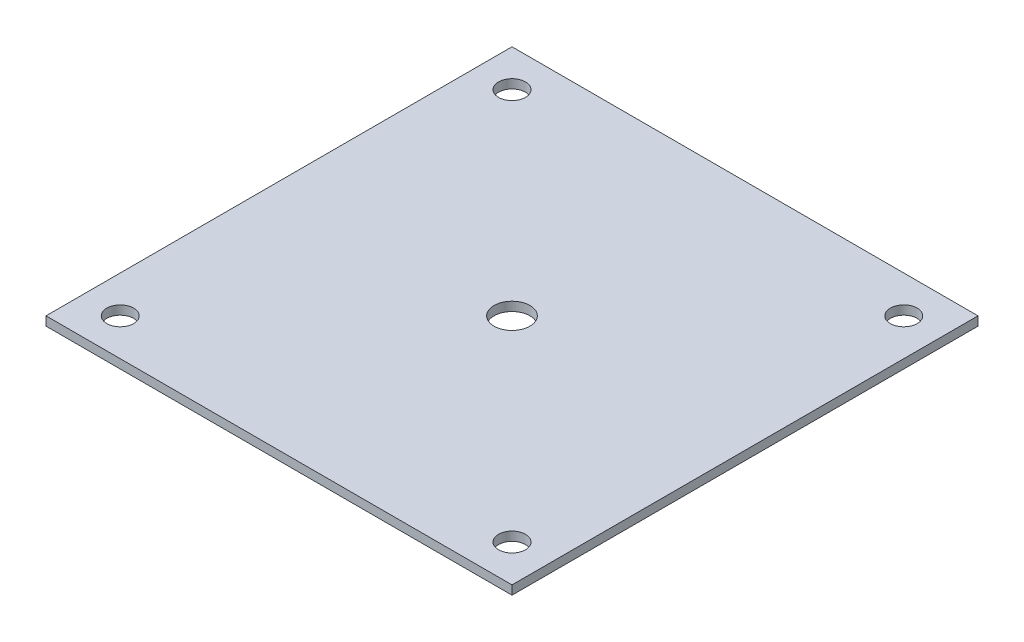
ISO-10303-21;
HEADER;
FILE_DESCRIPTION(('STEP AP214'),'2;1');
FILE_NAME('part.step','',(''),(''),'','','');
FILE_SCHEMA(('AUTOMOTIVE_DESIGN { 1 0 10303 214 1 1 1 1 }'));
ENDSEC;
DATA;
#1=APPLICATION_CONTEXT('core data for automotive mechanical design processes');
#2=APPLICATION_PROTOCOL_DEFINITION('international standard','automotive_design',2000,#1);
#3=PRODUCT_CONTEXT('',#1,'mechanical');
#4=PRODUCT('Part','Part','',(#3));
#5=PRODUCT_RELATED_PRODUCT_CATEGORY('part','',(#4));
#6=PRODUCT_DEFINITION_FORMATION('','',#4);
#7=PRODUCT_DEFINITION_CONTEXT('part definition',#1,'design');
#8=PRODUCT_DEFINITION('design','',#6,#7);
#9=PRODUCT_DEFINITION_SHAPE('','',#8);
#10=(LENGTH_UNIT() NAMED_UNIT(*) SI_UNIT(.MILLI.,.METRE.));
#11=(NAMED_UNIT(*) PLANE_ANGLE_UNIT() SI_UNIT($,.RADIAN.));
#12=(NAMED_UNIT(*) SI_UNIT($,.STERADIAN.) SOLID_ANGLE_UNIT());
#13=UNCERTAINTY_MEASURE_WITH_UNIT(LENGTH_MEASURE(1.E-05),#10,'distance_accuracy_value','');
#14=(GEOMETRIC_REPRESENTATION_CONTEXT(3) GLOBAL_UNCERTAINTY_ASSIGNED_CONTEXT((#13)) GLOBAL_UNIT_ASSIGNED_CONTEXT((#10,
#11,#12)) REPRESENTATION_CONTEXT('',''));
#15=CARTESIAN_POINT('',(0.,0.,0.));
#16=DIRECTION('',(0.,0.,1.));
#17=DIRECTION('',(1.,0.,0.));
#18=AXIS2_PLACEMENT_3D('',#15,#16,#17);
#19=CARTESIAN_POINT('',(-82.55,-3.175,82.55));
#20=DIRECTION('',(-1.,0.,0.));
#21=DIRECTION('',(0.,0.,1.));
#22=AXIS2_PLACEMENT_3D('',#19,#20,#21);
#23=PLANE('',#22);
#24=DIRECTION('',(0.,0.,1.));
#25=VECTOR('',#24,1.);
#26=CARTESIAN_POINT('',(-82.55,0.,82.55));
#27=LINE('',#26,#25);
#28=CARTESIAN_POINT('',(-82.55,0.,-82.55));
#29=VERTEX_POINT('',#28);
#30=CARTESIAN_POINT('',(-82.55,0.,82.55));
#31=VERTEX_POINT('',#30);
#32=EDGE_CURVE('E400',#29,#31,#27,.T.);
#33=ORIENTED_EDGE('',*,*,#32,.F.);
#34=DIRECTION('',(0.,1.,0.));
#35=VECTOR('',#34,1.);
#36=CARTESIAN_POINT('',(-82.55,-3.175,-82.55));
#37=LINE('',#36,#35);
#38=CARTESIAN_POINT('',(-82.55,-3.175,-82.55));
#39=VERTEX_POINT('',#38);
#40=EDGE_CURVE('E11',#39,#29,#37,.T.);
#41=ORIENTED_EDGE('',*,*,#40,.F.);
#42=DIRECTION('',(0.,0.,1.));
#43=VECTOR('',#42,1.);
#44=CARTESIAN_POINT('',(-82.55,-3.175,82.55));
#45=LINE('',#44,#43);
#46=CARTESIAN_POINT('',(-82.55,-3.175,82.55));
#47=VERTEX_POINT('',#46);
#48=EDGE_CURVE('E402',#39,#47,#45,.T.);
#49=ORIENTED_EDGE('',*,*,#48,.T.);
#50=DIRECTION('',(0.,1.,0.));
#51=VECTOR('',#50,1.);
#52=CARTESIAN_POINT('',(-82.55,-3.175,82.55));
#53=LINE('',#52,#51);
#54=EDGE_CURVE('E363',#47,#31,#53,.T.);
#55=ORIENTED_EDGE('',*,*,#54,.T.);
#56=EDGE_LOOP('',(#33,#41,#49,#55));
#57=FACE_BOUND('',#56,.T.);
#58=ADVANCED_FACE('F360',(#57),#23,.T.);
#59=CARTESIAN_POINT('',(-82.55,-3.175,-82.55));
#60=DIRECTION('',(0.,0.,-1.));
#61=DIRECTION('',(-1.,0.,0.));
#62=AXIS2_PLACEMENT_3D('',#59,#60,#61);
#63=PLANE('',#62);
#64=DIRECTION('',(-1.,0.,0.));
#65=VECTOR('',#64,1.);
#66=CARTESIAN_POINT('',(-82.55,0.,-82.55));
#67=LINE('',#66,#65);
#68=CARTESIAN_POINT('',(82.55,0.,-82.55));
#69=VERTEX_POINT('',#68);
#70=EDGE_CURVE('E417',#69,#29,#67,.T.);
#71=ORIENTED_EDGE('',*,*,#70,.F.);
#72=DIRECTION('',(0.,1.,0.));
#73=VECTOR('',#72,1.);
#74=CARTESIAN_POINT('',(82.55,-3.175,-82.55));
#75=LINE('',#74,#73);
#76=CARTESIAN_POINT('',(82.55,-3.175,-82.55));
#77=VERTEX_POINT('',#76);
#78=EDGE_CURVE('E368',#77,#69,#75,.T.);
#79=ORIENTED_EDGE('',*,*,#78,.F.);
#80=DIRECTION('',(-1.,0.,0.));
#81=VECTOR('',#80,1.);
#82=CARTESIAN_POINT('',(-82.55,-3.175,-82.55));
#83=LINE('',#82,#81);
#84=EDGE_CURVE('E407',#77,#39,#83,.T.);
#85=ORIENTED_EDGE('',*,*,#84,.T.);
#86=ORIENTED_EDGE('',*,*,#40,.T.);
#87=EDGE_LOOP('',(#71,#79,#85,#86));
#88=FACE_BOUND('',#87,.T.);
#89=ADVANCED_FACE('F437',(#88),#63,.T.);
#90=CARTESIAN_POINT('',(82.55,-3.175,82.55));
#91=DIRECTION('',(1.,0.,0.));
#92=DIRECTION('',(0.,0.,-1.));
#93=AXIS2_PLACEMENT_3D('',#90,#91,#92);
#94=PLANE('',#93);
#95=DIRECTION('',(0.,0.,-1.));
#96=VECTOR('',#95,1.);
#97=CARTESIAN_POINT('',(82.55,0.,82.55));
#98=LINE('',#97,#96);
#99=CARTESIAN_POINT('',(82.55,0.,82.55));
#100=VERTEX_POINT('',#99);
#101=EDGE_CURVE('E414',#100,#69,#98,.T.);
#102=ORIENTED_EDGE('',*,*,#101,.F.);
#103=DIRECTION('',(0.,1.,0.));
#104=VECTOR('',#103,1.);
#105=CARTESIAN_POINT('',(82.55,-3.175,82.55));
#106=LINE('',#105,#104);
#107=CARTESIAN_POINT('',(82.55,-3.175,82.55));
#108=VERTEX_POINT('',#107);
#109=EDGE_CURVE('E406',#108,#100,#106,.T.);
#110=ORIENTED_EDGE('',*,*,#109,.F.);
#111=DIRECTION('',(0.,0.,-1.));
#112=VECTOR('',#111,1.);
#113=CARTESIAN_POINT('',(82.55,-3.175,82.55));
#114=LINE('',#113,#112);
#115=EDGE_CURVE('E430',#108,#77,#114,.T.);
#116=ORIENTED_EDGE('',*,*,#115,.T.);
#117=ORIENTED_EDGE('',*,*,#78,.T.);
#118=EDGE_LOOP('',(#102,#110,#116,#117));
#119=FACE_BOUND('',#118,.T.);
#120=ADVANCED_FACE('F434',(#119),#94,.T.);
#121=CARTESIAN_POINT('',(-82.55,-3.175,82.55));
#122=DIRECTION('',(0.,0.,1.));
#123=DIRECTION('',(1.,0.,0.));
#124=AXIS2_PLACEMENT_3D('',#121,#122,#123);
#125=PLANE('',#124);
#126=DIRECTION('',(1.,0.,0.));
#127=VECTOR('',#126,1.);
#128=CARTESIAN_POINT('',(-82.55,0.,82.55));
#129=LINE('',#128,#127);
#130=EDGE_CURVE('E409',#31,#100,#129,.T.);
#131=ORIENTED_EDGE('',*,*,#130,.F.);
#132=ORIENTED_EDGE('',*,*,#54,.F.);
#133=DIRECTION('',(1.,0.,0.));
#134=VECTOR('',#133,1.);
#135=CARTESIAN_POINT('',(-82.55,-3.175,82.55));
#136=LINE('',#135,#134);
#137=EDGE_CURVE('E428',#47,#108,#136,.T.);
#138=ORIENTED_EDGE('',*,*,#137,.T.);
#139=ORIENTED_EDGE('',*,*,#109,.T.);
#140=EDGE_LOOP('',(#131,#132,#138,#139));
#141=FACE_BOUND('',#140,.T.);
#142=ADVANCED_FACE('F410',(#141),#125,.T.);
#143=CARTESIAN_POINT('',(-82.55,-3.175,-82.55));
#144=DIRECTION('',(0.,-1.,0.));
#145=DIRECTION('',(0.,0.,-1.));
#146=AXIS2_PLACEMENT_3D('',#143,#144,#145);
#147=PLANE('',#146);
#148=CARTESIAN_POINT('',(-69.40042,-3.175,69.40042));
#149=DIRECTION('',(0.,1.,0.));
#150=DIRECTION('',(0.,0.,-1.));
#151=AXIS2_PLACEMENT_3D('',#148,#149,#150);
#152=CIRCLE('',#151,4.7625);
#153=CARTESIAN_POINT('',(-69.40042,-3.175,64.63792));
#154=VERTEX_POINT('',#153);
#155=EDGE_CURVE('E516',#154,#154,#152,.T.);
#156=ORIENTED_EDGE('',*,*,#155,.T.);
#157=EDGE_LOOP('',(#156));
#158=FACE_BOUND('',#157,.T.);
#159=CARTESIAN_POINT('',(69.40042,-3.175,69.40042));
#160=DIRECTION('',(0.,1.,0.));
#161=DIRECTION('',(0.,0.,1.));
#162=AXIS2_PLACEMENT_3D('',#159,#160,#161);
#163=CIRCLE('',#162,4.7625);
#164=CARTESIAN_POINT('',(69.40042,-3.175,74.16292));
#165=VERTEX_POINT('',#164);
#166=EDGE_CURVE('E526',#165,#165,#163,.T.);
#167=ORIENTED_EDGE('',*,*,#166,.T.);
#168=EDGE_LOOP('',(#167));
#169=FACE_BOUND('',#168,.T.);
#170=CARTESIAN_POINT('',(-69.40042,-3.175,-69.40042));
#171=DIRECTION('',(0.,1.,0.));
#172=DIRECTION('',(0.,0.,1.));
#173=AXIS2_PLACEMENT_3D('',#170,#171,#172);
#174=CIRCLE('',#173,4.7625);
#175=CARTESIAN_POINT('',(-69.40042,-3.175,-64.63792));
#176=VERTEX_POINT('',#175);
#177=EDGE_CURVE('E532',#176,#176,#174,.T.);
#178=ORIENTED_EDGE('',*,*,#177,.T.);
#179=EDGE_LOOP('',(#178));
#180=FACE_BOUND('',#179,.T.);
#181=CARTESIAN_POINT('',(69.40042,-3.175,-69.40042));
#182=DIRECTION('',(0.,1.,0.));
#183=DIRECTION('',(0.,0.,-1.));
#184=AXIS2_PLACEMENT_3D('',#181,#182,#183);
#185=CIRCLE('',#184,4.7625);
#186=CARTESIAN_POINT('',(69.40042,-3.175,-74.16292));
#187=VERTEX_POINT('',#186);
#188=EDGE_CURVE('E538',#187,#187,#185,.T.);
#189=ORIENTED_EDGE('',*,*,#188,.T.);
#190=EDGE_LOOP('',(#189));
#191=FACE_BOUND('',#190,.T.);
#192=CARTESIAN_POINT('',(0.,-3.175,0.));
#193=DIRECTION('',(0.,1.,0.));
#194=DIRECTION('',(0.,0.,1.));
#195=AXIS2_PLACEMENT_3D('',#192,#193,#194);
#196=CIRCLE('',#195,6.35);
#197=CARTESIAN_POINT('',(0.,-3.175,6.35));
#198=VERTEX_POINT('',#197);
#199=EDGE_CURVE('E418',#198,#198,#196,.T.);
#200=ORIENTED_EDGE('',*,*,#199,.T.);
#201=EDGE_LOOP('',(#200));
#202=FACE_BOUND('',#201,.T.);
#203=ORIENTED_EDGE('',*,*,#48,.F.);
#204=ORIENTED_EDGE('',*,*,#84,.F.);
#205=ORIENTED_EDGE('',*,*,#115,.F.);
#206=ORIENTED_EDGE('',*,*,#137,.F.);
#207=EDGE_LOOP('',(#203,#204,#205,#206));
#208=FACE_BOUND('',#207,.T.);
#209=ADVANCED_FACE('F439',(#158,#169,#180,#191,#202,#208),#147,.T.);
#210=CARTESIAN_POINT('',(-82.55,0.,-82.55));
#211=DIRECTION('',(0.,-1.,0.));
#212=DIRECTION('',(0.,0.,-1.));
#213=AXIS2_PLACEMENT_3D('',#210,#211,#212);
#214=PLANE('',#213);
#215=CARTESIAN_POINT('',(-69.40042,0.,69.40042));
#216=DIRECTION('',(0.,1.,0.));
#217=DIRECTION('',(0.,0.,-1.));
#218=AXIS2_PLACEMENT_3D('',#215,#216,#217);
#219=CIRCLE('',#218,4.7625);
#220=CARTESIAN_POINT('',(-69.40042,0.,64.63792));
#221=VERTEX_POINT('',#220);
#222=EDGE_CURVE('E519',#221,#221,#219,.T.);
#223=ORIENTED_EDGE('',*,*,#222,.F.);
#224=EDGE_LOOP('',(#223));
#225=FACE_BOUND('',#224,.T.);
#226=CARTESIAN_POINT('',(69.40042,0.,69.40042));
#227=DIRECTION('',(0.,1.,0.));
#228=DIRECTION('',(0.,0.,1.));
#229=AXIS2_PLACEMENT_3D('',#226,#227,#228);
#230=CIRCLE('',#229,4.7625);
#231=CARTESIAN_POINT('',(69.40042,0.,74.16292));
#232=VERTEX_POINT('',#231);
#233=EDGE_CURVE('E521',#232,#232,#230,.T.);
#234=ORIENTED_EDGE('',*,*,#233,.F.);
#235=EDGE_LOOP('',(#234));
#236=FACE_BOUND('',#235,.T.);
#237=CARTESIAN_POINT('',(-69.40042,0.,-69.40042));
#238=DIRECTION('',(0.,1.,0.));
#239=DIRECTION('',(0.,0.,1.));
#240=AXIS2_PLACEMENT_3D('',#237,#238,#239);
#241=CIRCLE('',#240,4.7625);
#242=CARTESIAN_POINT('',(-69.40042,0.,-64.63792));
#243=VERTEX_POINT('',#242);
#244=EDGE_CURVE('E529',#243,#243,#241,.T.);
#245=ORIENTED_EDGE('',*,*,#244,.F.);
#246=EDGE_LOOP('',(#245));
#247=FACE_BOUND('',#246,.T.);
#248=CARTESIAN_POINT('',(69.40042,0.,-69.40042));
#249=DIRECTION('',(0.,1.,0.));
#250=DIRECTION('',(0.,0.,-1.));
#251=AXIS2_PLACEMENT_3D('',#248,#249,#250);
#252=CIRCLE('',#251,4.7625);
#253=CARTESIAN_POINT('',(69.40042,0.,-74.16292));
#254=VERTEX_POINT('',#253);
#255=EDGE_CURVE('E535',#254,#254,#252,.T.);
#256=ORIENTED_EDGE('',*,*,#255,.F.);
#257=EDGE_LOOP('',(#256));
#258=FACE_BOUND('',#257,.T.);
#259=CARTESIAN_POINT('',(0.,0.,0.));
#260=DIRECTION('',(0.,1.,0.));
#261=DIRECTION('',(0.,0.,1.));
#262=AXIS2_PLACEMENT_3D('',#259,#260,#261);
#263=CIRCLE('',#262,6.35);
#264=CARTESIAN_POINT('',(0.,0.,6.35));
#265=VERTEX_POINT('',#264);
#266=EDGE_CURVE('E421',#265,#265,#263,.T.);
#267=ORIENTED_EDGE('',*,*,#266,.F.);
#268=EDGE_LOOP('',(#267));
#269=FACE_BOUND('',#268,.T.);
#270=ORIENTED_EDGE('',*,*,#32,.T.);
#271=ORIENTED_EDGE('',*,*,#130,.T.);
#272=ORIENTED_EDGE('',*,*,#101,.T.);
#273=ORIENTED_EDGE('',*,*,#70,.T.);
#274=EDGE_LOOP('',(#270,#271,#272,#273));
#275=FACE_BOUND('',#274,.T.);
#276=ADVANCED_FACE('F416',(#225,#236,#247,#258,#269,#275),#214,.F.);
#277=CARTESIAN_POINT('',(0.,-3.175,0.));
#278=DIRECTION('',(0.,1.,0.));
#279=DIRECTION('',(0.,0.,1.));
#280=AXIS2_PLACEMENT_3D('',#277,#278,#279);
#281=CYLINDRICAL_SURFACE('',#280,6.35);
#282=ORIENTED_EDGE('',*,*,#199,.F.);
#283=EDGE_LOOP('',(#282));
#284=FACE_BOUND('',#283,.T.);
#285=ORIENTED_EDGE('',*,*,#266,.T.);
#286=EDGE_LOOP('',(#285));
#287=FACE_BOUND('',#286,.T.);
#288=ADVANCED_FACE('F447',(#284,#287),#281,.F.);
#289=CARTESIAN_POINT('',(69.40042,-3.175,-69.40042));
#290=DIRECTION('',(0.,1.,0.));
#291=DIRECTION('',(0.,0.,1.));
#292=AXIS2_PLACEMENT_3D('',#289,#290,#291);
#293=CYLINDRICAL_SURFACE('',#292,4.7625);
#294=ORIENTED_EDGE('',*,*,#188,.F.);
#295=EDGE_LOOP('',(#294));
#296=FACE_BOUND('',#295,.T.);
#297=ORIENTED_EDGE('',*,*,#255,.T.);
#298=EDGE_LOOP('',(#297));
#299=FACE_BOUND('',#298,.T.);
#300=ADVANCED_FACE('F480',(#296,#299),#293,.F.);
#301=CARTESIAN_POINT('',(-69.40042,-3.175,-69.40042));
#302=DIRECTION('',(0.,1.,0.));
#303=DIRECTION('',(0.,0.,1.));
#304=AXIS2_PLACEMENT_3D('',#301,#302,#303);
#305=CYLINDRICAL_SURFACE('',#304,4.7625);
#306=ORIENTED_EDGE('',*,*,#177,.F.);
#307=EDGE_LOOP('',(#306));
#308=FACE_BOUND('',#307,.T.);
#309=ORIENTED_EDGE('',*,*,#244,.T.);
#310=EDGE_LOOP('',(#309));
#311=FACE_BOUND('',#310,.T.);
#312=ADVANCED_FACE('F488',(#308,#311),#305,.F.);
#313=CARTESIAN_POINT('',(69.40042,-3.175,69.40042));
#314=DIRECTION('',(0.,1.,0.));
#315=DIRECTION('',(0.,0.,1.));
#316=AXIS2_PLACEMENT_3D('',#313,#314,#315);
#317=CYLINDRICAL_SURFACE('',#316,4.7625);
#318=ORIENTED_EDGE('',*,*,#166,.F.);
#319=EDGE_LOOP('',(#318));
#320=FACE_BOUND('',#319,.T.);
#321=ORIENTED_EDGE('',*,*,#233,.T.);
#322=EDGE_LOOP('',(#321));
#323=FACE_BOUND('',#322,.T.);
#324=ADVANCED_FACE('F496',(#320,#323),#317,.F.);
#325=CARTESIAN_POINT('',(-69.40042,-3.175,69.40042));
#326=DIRECTION('',(0.,1.,0.));
#327=DIRECTION('',(0.,0.,1.));
#328=AXIS2_PLACEMENT_3D('',#325,#326,#327);
#329=CYLINDRICAL_SURFACE('',#328,4.7625);
#330=ORIENTED_EDGE('',*,*,#155,.F.);
#331=EDGE_LOOP('',(#330));
#332=FACE_BOUND('',#331,.T.);
#333=ORIENTED_EDGE('',*,*,#222,.T.);
#334=EDGE_LOOP('',(#333));
#335=FACE_BOUND('',#334,.T.);
#336=ADVANCED_FACE('F504',(#332,#335),#329,.F.);
#337=CLOSED_SHELL('',(#58,#89,#120,#142,#209,#276,#288,#300,#312,#324,#336));
#338=MANIFOLD_SOLID_BREP('B2',#337);
#339=ADVANCED_BREP_SHAPE_REPRESENTATION('',(#18,#338),#14);
#340=SHAPE_DEFINITION_REPRESENTATION(#9,#339);
ENDSEC;
END-ISO-10303-21;
